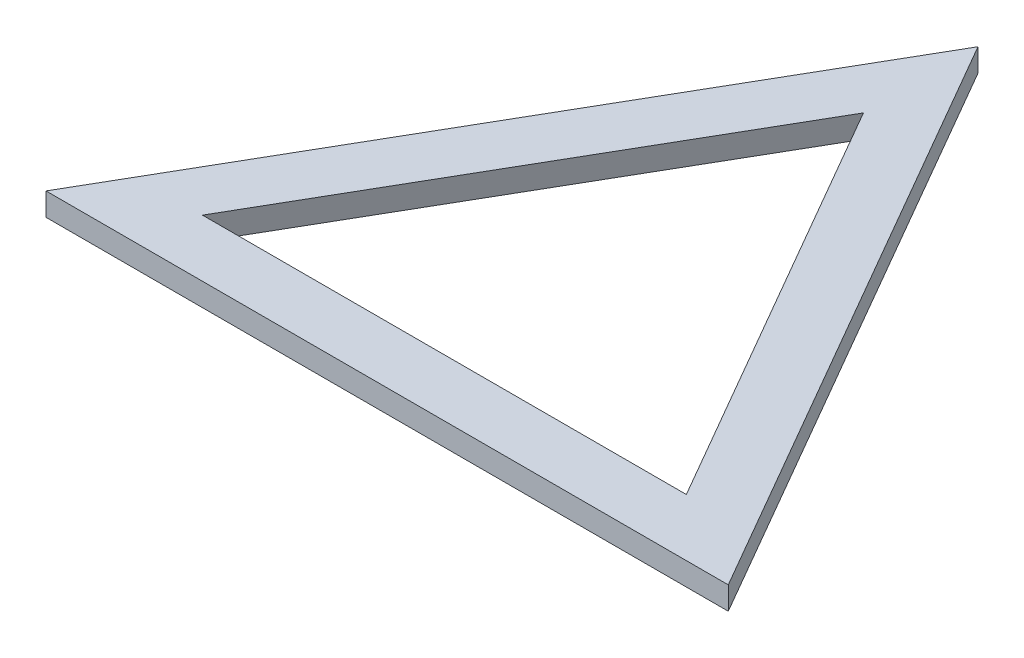
ISO-10303-21;
HEADER;
FILE_DESCRIPTION(('STEP AP214'),'2;1');
FILE_NAME('part.step','',(''),(''),'','','');
FILE_SCHEMA(('AUTOMOTIVE_DESIGN { 1 0 10303 214 1 1 1 1 }'));
ENDSEC;
DATA;
#1=APPLICATION_CONTEXT('core data for automotive mechanical design processes');
#2=APPLICATION_PROTOCOL_DEFINITION('international standard','automotive_design',2000,#1);
#3=PRODUCT_CONTEXT('',#1,'mechanical');
#4=PRODUCT('Part','Part','',(#3));
#5=PRODUCT_RELATED_PRODUCT_CATEGORY('part','',(#4));
#6=PRODUCT_DEFINITION_FORMATION('','',#4);
#7=PRODUCT_DEFINITION_CONTEXT('part definition',#1,'design');
#8=PRODUCT_DEFINITION('design','',#6,#7);
#9=PRODUCT_DEFINITION_SHAPE('','',#8);
#10=(LENGTH_UNIT() NAMED_UNIT(*) SI_UNIT(.MILLI.,.METRE.));
#11=(NAMED_UNIT(*) PLANE_ANGLE_UNIT() SI_UNIT($,.RADIAN.));
#12=(NAMED_UNIT(*) SI_UNIT($,.STERADIAN.) SOLID_ANGLE_UNIT());
#13=UNCERTAINTY_MEASURE_WITH_UNIT(LENGTH_MEASURE(1.E-05),#10,'distance_accuracy_value','');
#14=(GEOMETRIC_REPRESENTATION_CONTEXT(3) GLOBAL_UNCERTAINTY_ASSIGNED_CONTEXT((#13)) GLOBAL_UNIT_ASSIGNED_CONTEXT((#10,
#11,#12)) REPRESENTATION_CONTEXT('',''));
#15=CARTESIAN_POINT('',(0.,0.,0.));
#16=DIRECTION('',(0.,0.,1.));
#17=DIRECTION('',(1.,0.,0.));
#18=AXIS2_PLACEMENT_3D('',#15,#16,#17);
#19=CARTESIAN_POINT('',(29.8074,2.,-51.6279312415286));
#20=DIRECTION('',(0.866025403784439,0.,-0.5));
#21=DIRECTION('',(-0.5,0.,-0.866025403784439));
#22=AXIS2_PLACEMENT_3D('',#19,#20,#21);
#23=PLANE('',#22);
#24=DIRECTION('',(0.5,0.,0.866025403784439));
#25=VECTOR('',#24,1.);
#26=CARTESIAN_POINT('',(29.8074,0.,-51.6279312415286));
#27=LINE('',#26,#25);
#28=CARTESIAN_POINT('',(29.8074,0.,-51.6279312415286));
#29=VERTEX_POINT('',#28);
#30=CARTESIAN_POINT('',(59.6148,0.,0.));
#31=VERTEX_POINT('',#30);
#32=EDGE_CURVE('E145',#29,#31,#27,.T.);
#33=ORIENTED_EDGE('',*,*,#32,.F.);
#34=DIRECTION('',(0.,-1.,0.));
#35=VECTOR('',#34,1.);
#36=CARTESIAN_POINT('',(29.8074,2.,-51.6279312415286));
#37=LINE('',#36,#35);
#38=CARTESIAN_POINT('',(29.8074,2.,-51.6279312415286));
#39=VERTEX_POINT('',#38);
#40=EDGE_CURVE('E12',#39,#29,#37,.T.);
#41=ORIENTED_EDGE('',*,*,#40,.F.);
#42=DIRECTION('',(0.5,0.,0.866025403784439));
#43=VECTOR('',#42,1.);
#44=CARTESIAN_POINT('',(29.8074,2.,-51.6279312415286));
#45=LINE('',#44,#43);
#46=CARTESIAN_POINT('',(59.6148,2.,0.));
#47=VERTEX_POINT('',#46);
#48=EDGE_CURVE('E148',#39,#47,#45,.T.);
#49=ORIENTED_EDGE('',*,*,#48,.T.);
#50=DIRECTION('',(0.,-1.,0.));
#51=VECTOR('',#50,1.);
#52=CARTESIAN_POINT('',(59.6148,2.,0.));
#53=LINE('',#52,#51);
#54=EDGE_CURVE('E60',#47,#31,#53,.T.);
#55=ORIENTED_EDGE('',*,*,#54,.T.);
#56=EDGE_LOOP('',(#33,#41,#49,#55));
#57=FACE_BOUND('',#56,.T.);
#58=ADVANCED_FACE('F57',(#57),#23,.T.);
#59=CARTESIAN_POINT('',(0.,2.,0.));
#60=DIRECTION('',(-0.866025403784439,0.,-0.5));
#61=DIRECTION('',(-0.5,0.,0.866025403784439));
#62=AXIS2_PLACEMENT_3D('',#59,#60,#61);
#63=PLANE('',#62);
#64=DIRECTION('',(0.5,0.,-0.866025403784439));
#65=VECTOR('',#64,1.);
#66=CARTESIAN_POINT('',(0.,0.,0.));
#67=LINE('',#66,#65);
#68=CARTESIAN_POINT('',(0.,0.,0.));
#69=VERTEX_POINT('',#68);
#70=EDGE_CURVE('E153',#69,#29,#67,.T.);
#71=ORIENTED_EDGE('',*,*,#70,.F.);
#72=DIRECTION('',(0.,-1.,0.));
#73=VECTOR('',#72,1.);
#74=CARTESIAN_POINT('',(0.,2.,0.));
#75=LINE('',#74,#73);
#76=CARTESIAN_POINT('',(0.,2.,0.));
#77=VERTEX_POINT('',#76);
#78=EDGE_CURVE('E66',#77,#69,#75,.T.);
#79=ORIENTED_EDGE('',*,*,#78,.F.);
#80=DIRECTION('',(0.5,0.,-0.866025403784439));
#81=VECTOR('',#80,1.);
#82=CARTESIAN_POINT('',(0.,2.,0.));
#83=LINE('',#82,#81);
#84=EDGE_CURVE('E157',#77,#39,#83,.T.);
#85=ORIENTED_EDGE('',*,*,#84,.T.);
#86=ORIENTED_EDGE('',*,*,#40,.T.);
#87=EDGE_LOOP('',(#71,#79,#85,#86));
#88=FACE_BOUND('',#87,.T.);
#89=ADVANCED_FACE('F183',(#88),#63,.T.);
#90=CARTESIAN_POINT('',(59.6148,2.,0.));
#91=DIRECTION('',(0.,0.,1.));
#92=DIRECTION('',(1.,0.,0.));
#93=AXIS2_PLACEMENT_3D('',#90,#91,#92);
#94=PLANE('',#93);
#95=DIRECTION('',(-1.,0.,0.));
#96=VECTOR('',#95,1.);
#97=CARTESIAN_POINT('',(59.6148,0.,0.));
#98=LINE('',#97,#96);
#99=EDGE_CURVE('E164',#31,#69,#98,.T.);
#100=ORIENTED_EDGE('',*,*,#99,.F.);
#101=ORIENTED_EDGE('',*,*,#54,.F.);
#102=DIRECTION('',(-1.,0.,0.));
#103=VECTOR('',#102,1.);
#104=CARTESIAN_POINT('',(59.6148,2.,0.));
#105=LINE('',#104,#103);
#106=EDGE_CURVE('E152',#47,#77,#105,.T.);
#107=ORIENTED_EDGE('',*,*,#106,.T.);
#108=ORIENTED_EDGE('',*,*,#78,.T.);
#109=EDGE_LOOP('',(#100,#101,#107,#108));
#110=FACE_BOUND('',#109,.T.);
#111=ADVANCED_FACE('F178',(#110),#94,.T.);
#112=CARTESIAN_POINT('',(0.,2.,0.));
#113=DIRECTION('',(0.,-1.,0.));
#114=DIRECTION('',(0.,0.,-1.));
#115=AXIS2_PLACEMENT_3D('',#112,#113,#114);
#116=PLANE('',#115);
#117=DIRECTION('',(0.5,0.,-0.866025403784439));
#118=VECTOR('',#117,1.);
#119=CARTESIAN_POINT('',(8.6674,2.,-5.00412572317416));
#120=LINE('',#119,#118);
#121=CARTESIAN_POINT('',(8.6674,2.,-5.00412572317416));
#122=VERTEX_POINT('',#121);
#123=CARTESIAN_POINT('',(29.8074,2.,-41.6196797951802));
#124=VERTEX_POINT('',#123);
#125=EDGE_CURVE('E74',#122,#124,#120,.T.);
#126=ORIENTED_EDGE('',*,*,#125,.T.);
#127=DIRECTION('',(0.5,0.,0.866025403784439));
#128=VECTOR('',#127,1.);
#129=CARTESIAN_POINT('',(29.8074,2.,-41.6196797951802));
#130=LINE('',#129,#128);
#131=CARTESIAN_POINT('',(50.9474,2.,-5.00412572317416));
#132=VERTEX_POINT('',#131);
#133=EDGE_CURVE('E113',#124,#132,#130,.T.);
#134=ORIENTED_EDGE('',*,*,#133,.T.);
#135=DIRECTION('',(-1.,0.,0.));
#136=VECTOR('',#135,1.);
#137=CARTESIAN_POINT('',(50.9474,2.,-5.00412572317416));
#138=LINE('',#137,#136);
#139=EDGE_CURVE('E121',#132,#122,#138,.T.);
#140=ORIENTED_EDGE('',*,*,#139,.T.);
#141=EDGE_LOOP('',(#126,#134,#140));
#142=FACE_BOUND('',#141,.T.);
#143=ORIENTED_EDGE('',*,*,#48,.F.);
#144=ORIENTED_EDGE('',*,*,#84,.F.);
#145=ORIENTED_EDGE('',*,*,#106,.F.);
#146=EDGE_LOOP('',(#143,#144,#145));
#147=FACE_BOUND('',#146,.T.);
#148=ADVANCED_FACE('F126',(#142,#147),#116,.F.);
#149=CARTESIAN_POINT('',(0.,0.,0.));
#150=DIRECTION('',(0.,-1.,0.));
#151=DIRECTION('',(0.,0.,-1.));
#152=AXIS2_PLACEMENT_3D('',#149,#150,#151);
#153=PLANE('',#152);
#154=DIRECTION('',(0.5,0.,0.866025403784439));
#155=VECTOR('',#154,1.);
#156=CARTESIAN_POINT('',(29.8074,0.,-41.6196797951802));
#157=LINE('',#156,#155);
#158=CARTESIAN_POINT('',(29.8074,0.,-41.6196797951802));
#159=VERTEX_POINT('',#158);
#160=CARTESIAN_POINT('',(50.9474,0.,-5.00412572317416));
#161=VERTEX_POINT('',#160);
#162=EDGE_CURVE('E82',#159,#161,#157,.T.);
#163=ORIENTED_EDGE('',*,*,#162,.F.);
#164=DIRECTION('',(0.5,0.,-0.866025403784439));
#165=VECTOR('',#164,1.);
#166=CARTESIAN_POINT('',(8.6674,0.,-5.00412572317416));
#167=LINE('',#166,#165);
#168=CARTESIAN_POINT('',(8.6674,0.,-5.00412572317416));
#169=VERTEX_POINT('',#168);
#170=EDGE_CURVE('E129',#169,#159,#167,.T.);
#171=ORIENTED_EDGE('',*,*,#170,.F.);
#172=DIRECTION('',(-1.,0.,0.));
#173=VECTOR('',#172,1.);
#174=CARTESIAN_POINT('',(50.9474,0.,-5.00412572317416));
#175=LINE('',#174,#173);
#176=EDGE_CURVE('E133',#161,#169,#175,.T.);
#177=ORIENTED_EDGE('',*,*,#176,.F.);
#178=EDGE_LOOP('',(#163,#171,#177));
#179=FACE_BOUND('',#178,.T.);
#180=ORIENTED_EDGE('',*,*,#32,.T.);
#181=ORIENTED_EDGE('',*,*,#99,.T.);
#182=ORIENTED_EDGE('',*,*,#70,.T.);
#183=EDGE_LOOP('',(#180,#181,#182));
#184=FACE_BOUND('',#183,.T.);
#185=ADVANCED_FACE('F181',(#179,#184),#153,.T.);
#186=CARTESIAN_POINT('',(29.8074,2.,-41.6196797951802));
#187=DIRECTION('',(0.866025403784439,0.,-0.5));
#188=DIRECTION('',(-0.5,0.,-0.866025403784439));
#189=AXIS2_PLACEMENT_3D('',#186,#187,#188);
#190=PLANE('',#189);
#191=ORIENTED_EDGE('',*,*,#162,.T.);
#192=DIRECTION('',(0.,-1.,0.));
#193=VECTOR('',#192,1.);
#194=CARTESIAN_POINT('',(50.9474,2.,-5.00412572317416));
#195=LINE('',#194,#193);
#196=EDGE_CURVE('E109',#132,#161,#195,.T.);
#197=ORIENTED_EDGE('',*,*,#196,.F.);
#198=ORIENTED_EDGE('',*,*,#133,.F.);
#199=DIRECTION('',(0.,-1.,0.));
#200=VECTOR('',#199,1.);
#201=CARTESIAN_POINT('',(29.8074,2.,-41.6196797951802));
#202=LINE('',#201,#200);
#203=EDGE_CURVE('E142',#124,#159,#202,.T.);
#204=ORIENTED_EDGE('',*,*,#203,.T.);
#205=EDGE_LOOP('',(#191,#197,#198,#204));
#206=FACE_BOUND('',#205,.T.);
#207=ADVANCED_FACE('F111',(#206),#190,.F.);
#208=CARTESIAN_POINT('',(8.6674,2.,-5.00412572317416));
#209=DIRECTION('',(-0.866025403784439,0.,-0.5));
#210=DIRECTION('',(-0.5,0.,0.866025403784439));
#211=AXIS2_PLACEMENT_3D('',#208,#209,#210);
#212=PLANE('',#211);
#213=ORIENTED_EDGE('',*,*,#170,.T.);
#214=ORIENTED_EDGE('',*,*,#203,.F.);
#215=ORIENTED_EDGE('',*,*,#125,.F.);
#216=DIRECTION('',(0.,-1.,0.));
#217=VECTOR('',#216,1.);
#218=CARTESIAN_POINT('',(8.6674,2.,-5.00412572317416));
#219=LINE('',#218,#217);
#220=EDGE_CURVE('E118',#122,#169,#219,.T.);
#221=ORIENTED_EDGE('',*,*,#220,.T.);
#222=EDGE_LOOP('',(#213,#214,#215,#221));
#223=FACE_BOUND('',#222,.T.);
#224=ADVANCED_FACE('F224',(#223),#212,.F.);
#225=CARTESIAN_POINT('',(50.9474,2.,-5.00412572317416));
#226=DIRECTION('',(0.,0.,1.));
#227=DIRECTION('',(1.,0.,0.));
#228=AXIS2_PLACEMENT_3D('',#225,#226,#227);
#229=PLANE('',#228);
#230=ORIENTED_EDGE('',*,*,#176,.T.);
#231=ORIENTED_EDGE('',*,*,#220,.F.);
#232=ORIENTED_EDGE('',*,*,#139,.F.);
#233=ORIENTED_EDGE('',*,*,#196,.T.);
#234=EDGE_LOOP('',(#230,#231,#232,#233));
#235=FACE_BOUND('',#234,.T.);
#236=ADVANCED_FACE('F122',(#235),#229,.F.);
#237=CLOSED_SHELL('',(#58,#89,#111,#148,#185,#207,#224,#236));
#238=MANIFOLD_SOLID_BREP('B2',#237);
#239=ADVANCED_BREP_SHAPE_REPRESENTATION('',(#18,#238),#14);
#240=SHAPE_DEFINITION_REPRESENTATION(#9,#239);
ENDSEC;
END-ISO-10303-21;
